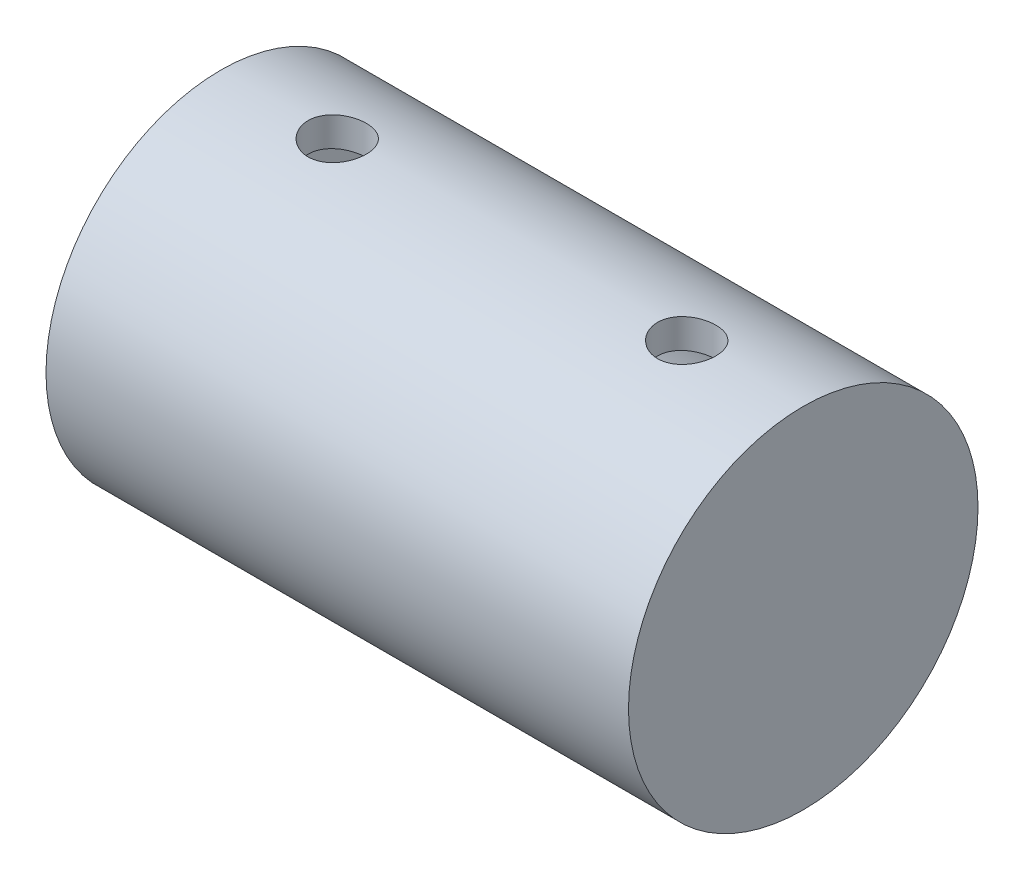
ISO-10303-21;
HEADER;
FILE_DESCRIPTION(('STEP AP214'),'2;1');
FILE_NAME('part.step','',(''),(''),'','','');
FILE_SCHEMA(('AUTOMOTIVE_DESIGN { 1 0 10303 214 1 1 1 1 }'));
ENDSEC;
DATA;
#1=APPLICATION_CONTEXT('core data for automotive mechanical design processes');
#2=APPLICATION_PROTOCOL_DEFINITION('international standard','automotive_design',2000,#1);
#3=PRODUCT_CONTEXT('',#1,'mechanical');
#4=PRODUCT('Part','Part','',(#3));
#5=PRODUCT_RELATED_PRODUCT_CATEGORY('part','',(#4));
#6=PRODUCT_DEFINITION_FORMATION('','',#4);
#7=PRODUCT_DEFINITION_CONTEXT('part definition',#1,'design');
#8=PRODUCT_DEFINITION('design','',#6,#7);
#9=PRODUCT_DEFINITION_SHAPE('','',#8);
#10=(LENGTH_UNIT() NAMED_UNIT(*) SI_UNIT(.MILLI.,.METRE.));
#11=(NAMED_UNIT(*) PLANE_ANGLE_UNIT() SI_UNIT($,.RADIAN.));
#12=(NAMED_UNIT(*) SI_UNIT($,.STERADIAN.) SOLID_ANGLE_UNIT());
#13=UNCERTAINTY_MEASURE_WITH_UNIT(LENGTH_MEASURE(1.E-05),#10,'distance_accuracy_value','');
#14=(GEOMETRIC_REPRESENTATION_CONTEXT(3) GLOBAL_UNCERTAINTY_ASSIGNED_CONTEXT((#13)) GLOBAL_UNIT_ASSIGNED_CONTEXT((#10,
#11,#12)) REPRESENTATION_CONTEXT('',''));
#15=CARTESIAN_POINT('',(0.,0.,0.));
#16=DIRECTION('',(0.,0.,1.));
#17=DIRECTION('',(1.,0.,0.));
#18=AXIS2_PLACEMENT_3D('',#15,#16,#17);
#19=CARTESIAN_POINT('',(25.,0.,0.));
#20=DIRECTION('',(-1.,0.,0.));
#21=DIRECTION('',(0.,0.,1.));
#22=AXIS2_PLACEMENT_3D('',#19,#20,#21);
#23=CYLINDRICAL_SURFACE('',#22,12.5);
#24=CARTESIAN_POINT('',(15.,12.2474487139159,-2.50000000000002));
#25=CARTESIAN_POINT('',(14.8610890612721,12.2474514756662,-2.4999948646882));
#26=CARTESIAN_POINT('',(14.7221134416666,12.2498377067175,-2.48838292929538));
#27=CARTESIAN_POINT('',(14.4480937371422,12.2591107826219,-2.44228070895713));
#28=CARTESIAN_POINT('',(14.31305288841,12.2660012286197,-2.40777211767626));
#29=CARTESIAN_POINT('',(14.0509067416145,12.2834718430464,-2.31698945654938));
#30=CARTESIAN_POINT('',(13.9237936961685,12.2940483405269,-2.26073703538157));
#31=CARTESIAN_POINT('',(13.6808128882576,12.3176949870165,-2.12812276917628));
#32=CARTESIAN_POINT('',(13.5649444986552,12.3307649968365,-2.0517620465029));
#33=CARTESIAN_POINT('',(13.3460974903653,12.3581324923563,-1.87994768913361));
#34=CARTESIAN_POINT('',(13.2433010302901,12.3724434459312,-1.78426413978331));
#35=CARTESIAN_POINT('',(13.0551061660525,12.400561807565,-1.57701697255329));
#36=CARTESIAN_POINT('',(12.969708981457,12.4143691802708,-1.46545224244497));
#37=CARTESIAN_POINT('',(12.8180299559288,12.440069910439,-1.22840338981065));
#38=CARTESIAN_POINT('',(12.7519212154584,12.4519455360388,-1.10280641918054));
#39=CARTESIAN_POINT('',(12.6418126573796,12.4722934220908,-0.842010375968186));
#40=CARTESIAN_POINT('',(12.5978107702475,12.480766001103,-0.706812203551389));
#41=CARTESIAN_POINT('',(12.5337320159509,12.4932580172105,-0.43254193319624));
#42=CARTESIAN_POINT('',(12.5133475560725,12.4973346572032,-0.293544348037038));
#43=CARTESIAN_POINT('',(12.4961226204042,12.5007730295901,-0.0140464210938411));
#44=CARTESIAN_POINT('',(12.4992798758854,12.500135216319,0.126453774579609));
#45=CARTESIAN_POINT('',(12.5288154505389,12.4942608717129,0.402855001858975));
#46=CARTESIAN_POINT('',(12.5548624429196,12.489089959146,0.538793035746179));
#47=CARTESIAN_POINT('',(12.6289125811472,12.4748044289852,0.80432906645076));
#48=CARTESIAN_POINT('',(12.6769166054797,12.465689653601,0.933926809367831));
#49=CARTESIAN_POINT('',(12.7938251003681,12.444432400499,1.18404865800223));
#50=CARTESIAN_POINT('',(12.8628593777622,12.4322712043806,1.30451043533476));
#51=CARTESIAN_POINT('',(13.0197726930915,12.4062617368446,1.5322626146494));
#52=CARTESIAN_POINT('',(13.1076538994263,12.3924132713806,1.63955149881252));
#53=CARTESIAN_POINT('',(13.3015840552712,12.3642741091115,1.83987857763366));
#54=CARTESIAN_POINT('',(13.407922966824,12.3499799114379,1.9326357914341));
#55=CARTESIAN_POINT('',(13.6347911061269,12.322789289969,2.09904623294204));
#56=CARTESIAN_POINT('',(13.755320602208,12.3098928926137,2.1726990993194));
#57=CARTESIAN_POINT('',(14.0075520795545,12.2869511868231,2.29890703700472));
#58=CARTESIAN_POINT('',(14.1392774190991,12.2769120390887,2.3514166194443));
#59=CARTESIAN_POINT('',(14.40992830931,12.2609119080318,2.43347585406898));
#60=CARTESIAN_POINT('',(14.5488529190477,12.2549503932107,2.46302849864163));
#61=CARTESIAN_POINT('',(14.8274121449976,12.2478869816957,2.49791501509015));
#62=CARTESIAN_POINT('',(14.9669939357758,12.2467036764289,2.5036546472448));
#63=CARTESIAN_POINT('',(15.2451205579992,12.2491121422213,2.49184407077687));
#64=CARTESIAN_POINT('',(15.3836654477972,12.2527036425097,2.47429518280613));
#65=CARTESIAN_POINT('',(15.6544216007306,12.2641808123729,2.41675552018541));
#66=CARTESIAN_POINT('',(15.7866808575894,12.2720249753624,2.37698155209827));
#67=CARTESIAN_POINT('',(16.0426581975719,12.2910872337916,2.27635258827131));
#68=CARTESIAN_POINT('',(16.1663755760893,12.3023056071567,2.21549585593296));
#69=CARTESIAN_POINT('',(16.4035327748754,12.327035149051,2.07351035553901));
#70=CARTESIAN_POINT('',(16.5168176157521,12.3405742966226,1.9921276949569));
#71=CARTESIAN_POINT('',(16.7282707800023,12.3683430956659,1.8117389305318));
#72=CARTESIAN_POINT('',(16.8264375456232,12.3825728180955,1.71273101286136));
#73=CARTESIAN_POINT('',(17.006406397964,12.4103836467304,1.49808068374474));
#74=CARTESIAN_POINT('',(17.087934136625,12.4239514427171,1.38220624732409));
#75=CARTESIAN_POINT('',(17.230364703749,12.4486781907155,1.1381697415869));
#76=CARTESIAN_POINT('',(17.291268398362,12.4598372438803,1.01000818858378));
#77=CARTESIAN_POINT('',(17.3903221793666,12.4784323515267,0.745756702060042));
#78=CARTESIAN_POINT('',(17.4286012955657,12.4858894785651,0.609716683695204));
#79=CARTESIAN_POINT('',(17.4817281191596,12.4963308984415,0.332973636699784));
#80=CARTESIAN_POINT('',(17.4965786486892,12.4993157299962,0.192271171778033));
#81=CARTESIAN_POINT('',(17.5023174524073,12.5004635113529,-0.0871822347590515));
#82=CARTESIAN_POINT('',(17.4936182011406,12.4987094637332,-0.225924530353734));
#83=CARTESIAN_POINT('',(17.4534151236305,12.4907510890085,-0.499927578289127));
#84=CARTESIAN_POINT('',(17.4219115841297,12.4845468178608,-0.63518837438431));
#85=CARTESIAN_POINT('',(17.337177519771,12.468387459123,-0.898131874362667));
#86=CARTESIAN_POINT('',(17.2839965546726,12.4584409311904,-1.02583110810042));
#87=CARTESIAN_POINT('',(17.1574693966722,12.435868053092,-1.27055305046518));
#88=CARTESIAN_POINT('',(17.0841216102388,12.4232414911747,-1.38757491441962));
#89=CARTESIAN_POINT('',(16.9179515323468,12.3964399789185,-1.6096597252648));
#90=CARTESIAN_POINT('',(16.8248341590406,12.3822433354475,-1.71449929028712));
#91=CARTESIAN_POINT('',(16.6223743997531,12.3540305726966,-1.90720654439628));
#92=CARTESIAN_POINT('',(16.5130281763002,12.340014496968,-1.9950702080223));
#93=CARTESIAN_POINT('',(16.2798017082739,12.3135835683483,-2.15223054862497));
#94=CARTESIAN_POINT('',(16.1557775971969,12.3011875892806,-2.22131703654524));
#95=CARTESIAN_POINT('',(15.8976680668498,12.2796309281603,-2.33756012316559));
#96=CARTESIAN_POINT('',(15.763591903282,12.2704673131246,-2.38473661493543));
#97=CARTESIAN_POINT('',(15.5243438613928,12.2582420284461,-2.44667284964416));
#98=CARTESIAN_POINT('',(15.4205364512151,12.2542196228651,-2.46663474630923));
#99=CARTESIAN_POINT('',(15.2111651136222,12.2488219614771,-2.4933000448993));
#100=CARTESIAN_POINT('',(15.1056012468888,12.2474466144104,-2.50000390390663));
#101=CARTESIAN_POINT('',(15.,12.2474487139159,-2.50000000000002));
#102=B_SPLINE_CURVE_WITH_KNOTS('',3,(#24,#25,#26,#27,#28,#29,#30,#31,#32,#33,#34,#35,#36,#37,
#38,#39,#40,#41,#42,#43,#44,#45,#46,#47,#48,#49,#50,#51,#52,#53,#54,#55,#56,#57,#58,#59,#60,#61,
#62,#63,#64,#65,#66,#67,#68,#69,#70,#71,#72,#73,#74,#75,#76,#77,#78,#79,#80,#81,#82,#83,#84,#85,
#86,#87,#88,#89,#90,#91,#92,#93,#94,#95,#96,#97,#98,#99,#100,#101),.UNSPECIFIED.,.T.,.F.,(4,2,2,
2,2,2,2,2,2,2,2,2,2,2,2,2,2,2,2,2,2,2,2,2,2,2,2,2,2,2,2,2,2,2,2,2,2,2,4),(0.,0.416346159673572,
0.833025598210749,1.24929124485148,1.66553366214967,2.08705631371094,2.50860850088557,
2.93383501093628,3.35902170616403,3.77860622207705,4.19815030290625,4.61171974083848,
5.0253057268438,5.44149810555763,5.8577383942517,6.28123366906214,6.70473695306807,
7.12914657931948,7.55350087540069,7.97059394511491,8.38766336321062,8.80073354458305,
9.21383775886004,9.63232649436312,10.0508583217553,10.4758150433364,10.9007539157527,
11.3232453394664,11.7456858672908,12.1607754353673,12.575859784169,12.9900004268864,
13.4041738033672,13.82502880064,14.2459834722447,14.6714724644903,15.0965743772551,
15.4130950909542,15.7296048921372),.UNSPECIFIED.);
#103=CARTESIAN_POINT('',(15.,12.2474487139159,-2.50000000000002));
#104=VERTEX_POINT('',#103);
#105=EDGE_CURVE('E54',#104,#104,#102,.T.);
#106=ORIENTED_EDGE('',*,*,#105,.T.);
#107=EDGE_LOOP('',(#106));
#108=FACE_BOUND('',#107,.T.);
#109=CARTESIAN_POINT('',(-20.,0.,0.));
#110=DIRECTION('',(1.,0.,0.));
#111=DIRECTION('',(0.,0.,-1.));
#112=AXIS2_PLACEMENT_3D('',#109,#110,#111);
#113=CIRCLE('',#112,12.5);
#114=CARTESIAN_POINT('',(-20.,0.,-12.5));
#115=VERTEX_POINT('',#114);
#116=EDGE_CURVE('E10',#115,#115,#113,.T.);
#117=ORIENTED_EDGE('',*,*,#116,.F.);
#118=EDGE_LOOP('',(#117));
#119=FACE_BOUND('',#118,.T.);
#120=CARTESIAN_POINT('',(20.,0.,0.));
#121=DIRECTION('',(1.,0.,0.));
#122=DIRECTION('',(0.,0.,-1.));
#123=AXIS2_PLACEMENT_3D('',#120,#121,#122);
#124=CIRCLE('',#123,12.5);
#125=CARTESIAN_POINT('',(20.,0.,-12.5));
#126=VERTEX_POINT('',#125);
#127=EDGE_CURVE('E86',#126,#126,#124,.T.);
#128=ORIENTED_EDGE('',*,*,#127,.T.);
#129=EDGE_LOOP('',(#128));
#130=FACE_BOUND('',#129,.T.);
#131=CARTESIAN_POINT('',(-15.,12.2474487139159,-2.5));
#132=CARTESIAN_POINT('',(-15.1389109387279,12.2474514756662,-2.49999486468818));
#133=CARTESIAN_POINT('',(-15.2778865583333,12.2498377067175,-2.48838292929536));
#134=CARTESIAN_POINT('',(-15.5519062628578,12.2591107826219,-2.4422807089571));
#135=CARTESIAN_POINT('',(-15.6869471115899,12.2660012286197,-2.40777211767623));
#136=CARTESIAN_POINT('',(-15.9490932583855,12.2834718430464,-2.31698945654936));
#137=CARTESIAN_POINT('',(-16.0762063038315,12.2940483405269,-2.26073703538155));
#138=CARTESIAN_POINT('',(-16.3191871117424,12.3176949870165,-2.12812276917626));
#139=CARTESIAN_POINT('',(-16.4350555013448,12.3307649968365,-2.05176204650288));
#140=CARTESIAN_POINT('',(-16.6539025096347,12.3581324923563,-1.87994768913359));
#141=CARTESIAN_POINT('',(-16.7566989697099,12.3724434459312,-1.78426413978329));
#142=CARTESIAN_POINT('',(-16.9448938339475,12.400561807565,-1.57701697255327));
#143=CARTESIAN_POINT('',(-17.030291018543,12.4143691802708,-1.46545224244496));
#144=CARTESIAN_POINT('',(-17.1819700440711,12.4400699104391,-1.22840338981064));
#145=CARTESIAN_POINT('',(-17.2480787845416,12.4519455360388,-1.10280641918053));
#146=CARTESIAN_POINT('',(-17.3581873426203,12.4722934220908,-0.842010375968181));
#147=CARTESIAN_POINT('',(-17.4021892297525,12.480766001103,-0.706812203551384));
#148=CARTESIAN_POINT('',(-17.4662679840491,12.4932580172105,-0.432541933196237));
#149=CARTESIAN_POINT('',(-17.4866524439275,12.4973346572032,-0.293544348037036));
#150=CARTESIAN_POINT('',(-17.5038773795958,12.5007730295901,-0.0140464210938419));
#151=CARTESIAN_POINT('',(-17.5007201241146,12.500135216319,0.126453774579607));
#152=CARTESIAN_POINT('',(-17.4711845494611,12.4942608717129,0.402855001858971));
#153=CARTESIAN_POINT('',(-17.4451375570804,12.489089959146,0.538793035746175));
#154=CARTESIAN_POINT('',(-17.3710874188528,12.4748044289852,0.804329066450753));
#155=CARTESIAN_POINT('',(-17.3230833945203,12.465689653601,0.933926809367823));
#156=CARTESIAN_POINT('',(-17.2061748996318,12.444432400499,1.18404865800222));
#157=CARTESIAN_POINT('',(-17.1371406222378,12.4322712043806,1.30451043533475));
#158=CARTESIAN_POINT('',(-16.9802273069085,12.4062617368446,1.53226261464939));
#159=CARTESIAN_POINT('',(-16.8923461005737,12.3924132713806,1.6395514988125));
#160=CARTESIAN_POINT('',(-16.6984159447288,12.3642741091115,1.83987857763364));
#161=CARTESIAN_POINT('',(-16.592077033176,12.3499799114379,1.93263579143408));
#162=CARTESIAN_POINT('',(-16.3652088938731,12.322789289969,2.09904623294202));
#163=CARTESIAN_POINT('',(-16.244679397792,12.3098928926137,2.17269909931938));
#164=CARTESIAN_POINT('',(-15.9924479204455,12.2869511868231,2.2989070370047));
#165=CARTESIAN_POINT('',(-15.8607225809008,12.2769120390887,2.35141661944427));
#166=CARTESIAN_POINT('',(-15.59007169069,12.2609119080318,2.43347585406895));
#167=CARTESIAN_POINT('',(-15.4511470809523,12.2549503932107,2.46302849864161));
#168=CARTESIAN_POINT('',(-15.1725878550024,12.2478869816957,2.49791501509013));
#169=CARTESIAN_POINT('',(-15.0330060642241,12.2467036764289,2.50365464724478));
#170=CARTESIAN_POINT('',(-14.7548794420008,12.2491121422213,2.49184407077685));
#171=CARTESIAN_POINT('',(-14.6163345522028,12.2527036425097,2.47429518280611));
#172=CARTESIAN_POINT('',(-14.3455783992694,12.2641808123729,2.41675552018539));
#173=CARTESIAN_POINT('',(-14.2133191424106,12.2720249753624,2.37698155209825));
#174=CARTESIAN_POINT('',(-13.9573418024281,12.2910872337916,2.27635258827129));
#175=CARTESIAN_POINT('',(-13.8336244239107,12.3023056071567,2.21549585593294));
#176=CARTESIAN_POINT('',(-13.5964672251246,12.327035149051,2.073510355539));
#177=CARTESIAN_POINT('',(-13.4831823842479,12.3405742966226,1.99212769495688));
#178=CARTESIAN_POINT('',(-13.2717292199977,12.3683430956659,1.81173893053178));
#179=CARTESIAN_POINT('',(-13.1735624543769,12.3825728180955,1.71273101286134));
#180=CARTESIAN_POINT('',(-12.9935936020361,12.4103836467304,1.49808068374473));
#181=CARTESIAN_POINT('',(-12.912065863375,12.4239514427171,1.38220624732407));
#182=CARTESIAN_POINT('',(-12.769635296251,12.4486781907155,1.13816974158689));
#183=CARTESIAN_POINT('',(-12.708731601638,12.4598372438803,1.01000818858377));
#184=CARTESIAN_POINT('',(-12.6096778206334,12.4784323515267,0.745756702060032));
#185=CARTESIAN_POINT('',(-12.5713987044344,12.4858894785651,0.609716683695196));
#186=CARTESIAN_POINT('',(-12.5182718808404,12.4963308984415,0.332973636699779));
#187=CARTESIAN_POINT('',(-12.5034213513108,12.4993157299962,0.192271171778029));
#188=CARTESIAN_POINT('',(-12.4976825475928,12.5004635113529,-0.0871822347590535));
#189=CARTESIAN_POINT('',(-12.5063817988594,12.4987094637332,-0.225924530353735));
#190=CARTESIAN_POINT('',(-12.5465848763696,12.4907510890085,-0.499927578289125));
#191=CARTESIAN_POINT('',(-12.5780884158703,12.4845468178608,-0.635188374384306));
#192=CARTESIAN_POINT('',(-12.662822480229,12.468387459123,-0.898131874362662));
#193=CARTESIAN_POINT('',(-12.7160034453274,12.4584409311904,-1.02583110810041));
#194=CARTESIAN_POINT('',(-12.8425306033278,12.435868053092,-1.27055305046517));
#195=CARTESIAN_POINT('',(-12.9158783897612,12.4232414911747,-1.38757491441961));
#196=CARTESIAN_POINT('',(-13.0820484676532,12.3964399789185,-1.60965972526479));
#197=CARTESIAN_POINT('',(-13.1751658409594,12.3822433354475,-1.71449929028711));
#198=CARTESIAN_POINT('',(-13.3776256002469,12.3540305726966,-1.90720654439627));
#199=CARTESIAN_POINT('',(-13.4869718236998,12.340014496968,-1.99507020802229));
#200=CARTESIAN_POINT('',(-13.7201982917261,12.3135835683483,-2.15223054862496));
#201=CARTESIAN_POINT('',(-13.8442224028031,12.3011875892806,-2.22131703654523));
#202=CARTESIAN_POINT('',(-14.1023319331503,12.2796309281603,-2.33756012316557));
#203=CARTESIAN_POINT('',(-14.236408096718,12.2704673131246,-2.38473661493541));
#204=CARTESIAN_POINT('',(-14.4756561386072,12.2582420284461,-2.44667284964414));
#205=CARTESIAN_POINT('',(-14.5794635487849,12.2542196228651,-2.46663474630921));
#206=CARTESIAN_POINT('',(-14.7888348863778,12.2488219614771,-2.49330004489928));
#207=CARTESIAN_POINT('',(-14.8943987531112,12.2474466144105,-2.50000390390661));
#208=CARTESIAN_POINT('',(-15.,12.2474487139159,-2.5));
#209=B_SPLINE_CURVE_WITH_KNOTS('',3,(#131,#132,#133,#134,#135,#136,#137,#138,#139,#140,#141,
#142,#143,#144,#145,#146,#147,#148,#149,#150,#151,#152,#153,#154,#155,#156,#157,#158,#159,#160,
#161,#162,#163,#164,#165,#166,#167,#168,#169,#170,#171,#172,#173,#174,#175,#176,#177,#178,#179,
#180,#181,#182,#183,#184,#185,#186,#187,#188,#189,#190,#191,#192,#193,#194,#195,#196,#197,#198,
#199,#200,#201,#202,#203,#204,#205,#206,#207,#208),.UNSPECIFIED.,.T.,.F.,(4,2,2,2,2,2,2,2,2,2,2,
2,2,2,2,2,2,2,2,2,2,2,2,2,2,2,2,2,2,2,2,2,2,2,2,2,2,2,4),(0.,0.416346159673569,
0.833025598210743,1.24929124485146,1.66553366214966,2.08705631371092,2.50860850088555,
2.93383501093625,3.35902170616399,3.77860622207701,4.19815030290621,4.61171974083844,
5.02530572684376,5.44149810555758,5.85773839425165,6.28123366906208,6.704736953068,
7.12914657931941,7.55350087540062,7.97059394511484,8.38766336321054,8.80073354458297,
9.21383775885996,9.63232649436303,10.0508583217552,10.4758150433363,10.9007539157526,
11.3232453394663,11.7456858672907,12.1607754353672,12.5758597841689,12.9900004268863,
13.4041738033671,13.8250288006399,14.2459834722445,14.6714724644902,15.096574377255,
15.413095090954,15.729604892137),.UNSPECIFIED.);
#210=CARTESIAN_POINT('',(-15.,12.2474487139159,-2.5));
#211=VERTEX_POINT('',#210);
#212=EDGE_CURVE('E37',#211,#211,#209,.T.);
#213=ORIENTED_EDGE('',*,*,#212,.T.);
#214=EDGE_LOOP('',(#213));
#215=FACE_BOUND('',#214,.T.);
#216=ADVANCED_FACE('F32',(#108,#119,#130,#215),#23,.F.);
#217=CARTESIAN_POINT('',(-20.,0.,0.));
#218=DIRECTION('',(1.,0.,0.));
#219=DIRECTION('',(0.,0.,-1.));
#220=AXIS2_PLACEMENT_3D('',#217,#218,#219);
#221=PLANE('',#220);
#222=ORIENTED_EDGE('',*,*,#116,.T.);
#223=EDGE_LOOP('',(#222));
#224=FACE_BOUND('',#223,.T.);
#225=ADVANCED_FACE('F72',(#224),#221,.T.);
#226=CARTESIAN_POINT('',(20.,0.,0.));
#227=DIRECTION('',(1.,0.,0.));
#228=DIRECTION('',(0.,0.,-1.));
#229=AXIS2_PLACEMENT_3D('',#226,#227,#228);
#230=PLANE('',#229);
#231=ORIENTED_EDGE('',*,*,#127,.F.);
#232=EDGE_LOOP('',(#231));
#233=FACE_BOUND('',#232,.T.);
#234=ADVANCED_FACE('F69',(#233),#230,.F.);
#235=CARTESIAN_POINT('',(15.,15.,0.));
#236=DIRECTION('',(0.,-1.,0.));
#237=DIRECTION('',(0.,0.,-1.));
#238=AXIS2_PLACEMENT_3D('',#235,#236,#237);
#239=CYLINDRICAL_SURFACE('',#238,2.50000000000002);
#240=ORIENTED_EDGE('',*,*,#105,.F.);
#241=EDGE_LOOP('',(#240));
#242=FACE_BOUND('',#241,.T.);
#243=CARTESIAN_POINT('',(12.5,15.,0.));
#244=CARTESIAN_POINT('',(12.5000055889478,14.9999976116882,0.139390904958216));
#245=CARTESIAN_POINT('',(12.5116972749689,14.9980367791303,0.278857881838823));
#246=CARTESIAN_POINT('',(12.5581356587653,14.9904034494139,0.553880221673048));
#247=CARTESIAN_POINT('',(12.5929035569116,14.9847275392389,0.689431867959254));
#248=CARTESIAN_POINT('',(12.6844154485927,14.9703006823645,0.952604747212653));
#249=CARTESIAN_POINT('',(12.7411414656406,14.9615522515919,1.08023236843191));
#250=CARTESIAN_POINT('',(12.8749122920524,14.9419422708207,1.32414184197796));
#251=CARTESIAN_POINT('',(12.951954777483,14.9310809625443,1.4404249898786));
#252=CARTESIAN_POINT('',(13.1249550838204,14.9083331745831,1.6594726142917));
#253=CARTESIAN_POINT('',(13.2210691146361,14.8964387181486,1.76211290353498));
#254=CARTESIAN_POINT('',(13.4291479684728,14.8730262687673,1.94988849865995));
#255=CARTESIAN_POINT('',(13.5411137914566,14.8615082996267,2.03502269939099));
#256=CARTESIAN_POINT('',(13.778570966197,14.8400756575978,2.18586712560515));
#257=CARTESIAN_POINT('',(13.9041413368047,14.8301712909164,2.25145455286102));
#258=CARTESIAN_POINT('',(14.1647095643006,14.8131978979467,2.36055836541124));
#259=CARTESIAN_POINT('',(14.2997067836776,14.8061286801431,2.40407624156564));
#260=CARTESIAN_POINT('',(14.5739802748565,14.7957053684275,2.46741437778483));
#261=CARTESIAN_POINT('',(14.7132057365014,14.792317684857,2.48744902913543));
#262=CARTESIAN_POINT('',(14.9930802768835,14.7895393893665,2.5039167252899));
#263=CARTESIAN_POINT('',(15.1337292541673,14.7901484945721,2.50035144038902));
#264=CARTESIAN_POINT('',(15.4109278612755,14.7952642886355,2.46989509839618));
#265=CARTESIAN_POINT('',(15.5475048035452,14.7997307331892,2.4432448818898));
#266=CARTESIAN_POINT('',(15.8142213178291,14.8119949521101,2.36775314040347));
#267=CARTESIAN_POINT('',(15.9443606688886,14.8197928407327,2.31891085431976));
#268=CARTESIAN_POINT('',(16.1952288234409,14.837884793341,2.20017724609393));
#269=CARTESIAN_POINT('',(16.3159094060812,14.8481906710733,2.13018591387974));
#270=CARTESIAN_POINT('',(16.5439044005384,14.8701291841501,1.97121201755745));
#271=CARTESIAN_POINT('',(16.6512177324549,14.8817619265429,1.88222792065431));
#272=CARTESIAN_POINT('',(16.8508260858074,14.9052202787979,1.68648221215907));
#273=CARTESIAN_POINT('',(16.9429185185401,14.9170464923165,1.57951396387314));
#274=CARTESIAN_POINT('',(17.1078777626654,14.9394260139672,1.35153524898166));
#275=CARTESIAN_POINT('',(17.1807444501832,14.9499793138975,1.23052469190643));
#276=CARTESIAN_POINT('',(17.3052022271363,14.9686389289291,0.97770591616672));
#277=CARTESIAN_POINT('',(17.3567754193313,14.9767431840745,0.845888725564669));
#278=CARTESIAN_POINT('',(17.436994215246,14.9895750301266,0.575298345602737));
#279=CARTESIAN_POINT('',(17.4656417369737,14.9943029035047,0.436525739179473));
#280=CARTESIAN_POINT('',(17.4989213584612,14.9998112984269,0.157709901301625));
#281=CARTESIAN_POINT('',(17.5038315718056,15.0006375301278,0.017700737151012));
#282=CARTESIAN_POINT('',(17.4902386555719,14.9983747442117,-0.261139772889889));
#283=CARTESIAN_POINT('',(17.4717364268663,14.9952858772412,-0.399971163892042));
#284=CARTESIAN_POINT('',(17.4120751506645,14.985568269382,-0.671656175546769));
#285=CARTESIAN_POINT('',(17.3710537916099,14.9789610480131,-0.804540868385385));
#286=CARTESIAN_POINT('',(17.2676654818005,14.9629446445536,-1.06154688486045));
#287=CARTESIAN_POINT('',(17.2052973323647,14.9535353051202,-1.18566771590973));
#288=CARTESIAN_POINT('',(17.0603488753032,14.9328451630241,-1.42283068946897));
#289=CARTESIAN_POINT('',(16.9775948438328,14.9215485588702,-1.53576525093716));
#290=CARTESIAN_POINT('',(16.794462684615,14.898384673919,-1.7462435855027));
#291=CARTESIAN_POINT('',(16.6940832767233,14.8865173517155,-1.8437862396966));
#292=CARTESIAN_POINT('',(16.4773024519286,14.8634017523585,-2.02174277965802));
#293=CARTESIAN_POINT('',(16.3607458344856,14.8521611613711,-2.10196876111373));
#294=CARTESIAN_POINT('',(16.1156470308615,14.8317152977788,-2.24170231029501));
#295=CARTESIAN_POINT('',(15.9871052247725,14.8225099606602,-2.30121053476985));
#296=CARTESIAN_POINT('',(15.7222102671879,14.807234536977,-2.39753833147317));
#297=CARTESIAN_POINT('',(15.5858919049695,14.8011515431106,-2.43445143254797));
#298=CARTESIAN_POINT('',(15.3088798707782,14.7927771683526,-2.4848354537783));
#299=CARTESIAN_POINT('',(15.1681865802679,14.7904854578272,-2.49830841194619));
#300=CARTESIAN_POINT('',(14.8882948340376,14.7899673308401,-2.50137286604738));
#301=CARTESIAN_POINT('',(14.7490996214247,14.7916905650565,-2.49126013612521));
#302=CARTESIAN_POINT('',(14.4744207519492,14.7988978145373,-2.44807983895687));
#303=CARTESIAN_POINT('',(14.3389370830581,14.8043818176121,-2.4150123461125));
#304=CARTESIAN_POINT('',(14.0756415627074,14.8184735628172,-2.32697448959492));
#305=CARTESIAN_POINT('',(13.947820989944,14.8270776721967,-2.27202959060046));
#306=CARTESIAN_POINT('',(13.7031643308051,14.8464436892221,-2.14182700391593));
#307=CARTESIAN_POINT('',(13.5863287896279,14.857205703884,-2.06656830874858));
#308=CARTESIAN_POINT('',(13.3654644168922,14.8798345404562,-1.89681888437217));
#309=CARTESIAN_POINT('',(13.2616039832997,14.891712955763,-1.80211056359367));
#310=CARTESIAN_POINT('',(13.071148395525,14.9151437236084,-1.59660903138025));
#311=CARTESIAN_POINT('',(12.9845572313618,14.9266960002655,-1.48581211291265));
#312=CARTESIAN_POINT('',(12.8305517318,14.9482652964222,-1.25036916964029));
#313=CARTESIAN_POINT('',(12.763273960687,14.958271162531,-1.12563278753283));
#314=CARTESIAN_POINT('',(12.6507305153901,14.9755116760178,-0.86651306937899));
#315=CARTESIAN_POINT('',(12.6054429189203,14.9827490817748,-0.732139494830018));
#316=CARTESIAN_POINT('',(12.5479947258733,14.9920579083296,-0.497703310045407));
#317=CARTESIAN_POINT('',(12.530025530384,14.9950202727336,-0.399058830298452));
#318=CARTESIAN_POINT('',(12.5060262621552,14.9989921598612,-0.200289310319812));
#319=CARTESIAN_POINT('',(12.4999959838626,15.0000017162064,-0.100164295608495));
#320=CARTESIAN_POINT('',(12.5,15.,0.));
#321=B_SPLINE_CURVE_WITH_KNOTS('',3,(#243,#244,#245,#246,#247,#248,#249,#250,#251,#252,#253,
#254,#255,#256,#257,#258,#259,#260,#261,#262,#263,#264,#265,#266,#267,#268,#269,#270,#271,#272,
#273,#274,#275,#276,#277,#278,#279,#280,#281,#282,#283,#284,#285,#286,#287,#288,#289,#290,#291,
#292,#293,#294,#295,#296,#297,#298,#299,#300,#301,#302,#303,#304,#305,#306,#307,#308,#309,#310,
#311,#312,#313,#314,#315,#316,#317,#318,#319,#320),.UNSPECIFIED.,.T.,.F.,(4,2,2,2,2,2,2,2,2,2,2,
2,2,2,2,2,2,2,2,2,2,2,2,2,2,2,2,2,2,2,2,2,2,2,2,2,2,2,4),(0.,0.417806584938513,
0.835997545695428,1.25384686702528,1.67164841267481,2.09302491062334,2.51442800169859,
2.93842520823843,3.36239376876184,3.78246077103427,4.2024980432089,4.61820521760413,
5.03392665025386,5.45164556632562,5.86939820680579,6.29232769911332,6.71525991635854,
7.1385468891591,7.56179844521156,7.98007883491405,8.39834313035867,8.81407807006424,
9.22983635826075,9.64926825627033,10.0687306305429,10.4925382200763,10.9163323737595,
11.3383602234178,11.7603513778663,12.1770790952271,12.5938054618814,13.0100481822623,
13.4263115502935,13.847513841934,14.2688133387899,14.6930223160721,15.1168075213009,
15.4170424816403,15.7172722727698),.UNSPECIFIED.);
#322=CARTESIAN_POINT('',(12.5,15.,0.));
#323=VERTEX_POINT('',#322);
#324=EDGE_CURVE('E60',#323,#323,#321,.T.);
#325=ORIENTED_EDGE('',*,*,#324,.T.);
#326=EDGE_LOOP('',(#325));
#327=FACE_BOUND('',#326,.T.);
#328=ADVANCED_FACE('F64',(#242,#327),#239,.F.);
#329=CARTESIAN_POINT('',(-15.,15.,0.));
#330=DIRECTION('',(0.,-1.,0.));
#331=DIRECTION('',(0.,0.,-1.));
#332=AXIS2_PLACEMENT_3D('',#329,#330,#331);
#333=CYLINDRICAL_SURFACE('',#332,2.5);
#334=ORIENTED_EDGE('',*,*,#212,.F.);
#335=EDGE_LOOP('',(#334));
#336=FACE_BOUND('',#335,.T.);
#337=CARTESIAN_POINT('',(-17.5,15.,0.));
#338=CARTESIAN_POINT('',(-17.4999944110522,14.9999976116882,0.139390904958215));
#339=CARTESIAN_POINT('',(-17.4883027250311,14.9980367791303,0.278857881838821));
#340=CARTESIAN_POINT('',(-17.4418643412347,14.9904034494139,0.553880221673043));
#341=CARTESIAN_POINT('',(-17.4070964430884,14.9847275392389,0.689431867959247));
#342=CARTESIAN_POINT('',(-17.3155845514072,14.9703006823645,0.952604747212644));
#343=CARTESIAN_POINT('',(-17.2588585343594,14.9615522515919,1.0802323684319));
#344=CARTESIAN_POINT('',(-17.1250877079476,14.9419422708207,1.32414184197795));
#345=CARTESIAN_POINT('',(-17.048045222517,14.9310809625443,1.44042498987859));
#346=CARTESIAN_POINT('',(-16.8750449161795,14.9083331745831,1.65947261429168));
#347=CARTESIAN_POINT('',(-16.7789308853639,14.8964387181486,1.76211290353497));
#348=CARTESIAN_POINT('',(-16.5708520315272,14.8730262687673,1.94988849865993));
#349=CARTESIAN_POINT('',(-16.4588862085434,14.8615082996267,2.03502269939097));
#350=CARTESIAN_POINT('',(-16.2214290338029,14.8400756575978,2.18586712560513));
#351=CARTESIAN_POINT('',(-16.0958586631952,14.8301712909164,2.251454552861));
#352=CARTESIAN_POINT('',(-15.8352904356994,14.8131978979467,2.36055836541122));
#353=CARTESIAN_POINT('',(-15.7002932163224,14.8061286801431,2.40407624156561));
#354=CARTESIAN_POINT('',(-15.4260197251435,14.7957053684276,2.46741437778481));
#355=CARTESIAN_POINT('',(-15.2867942634986,14.792317684857,2.4874490291354));
#356=CARTESIAN_POINT('',(-15.0069197231165,14.7895393893665,2.50391672528988));
#357=CARTESIAN_POINT('',(-14.8662707458327,14.7901484945721,2.500351440389));
#358=CARTESIAN_POINT('',(-14.5890721387245,14.7952642886356,2.46989509839615));
#359=CARTESIAN_POINT('',(-14.4524951964548,14.7997307331892,2.44324488188977));
#360=CARTESIAN_POINT('',(-14.1857786821709,14.8119949521101,2.36775314040344));
#361=CARTESIAN_POINT('',(-14.0556393311115,14.8197928407327,2.31891085431974));
#362=CARTESIAN_POINT('',(-13.8047711765591,14.837884793341,2.20017724609391));
#363=CARTESIAN_POINT('',(-13.6840905939188,14.8481906710733,2.13018591387971));
#364=CARTESIAN_POINT('',(-13.4560955994616,14.8701291841501,1.97121201755743));
#365=CARTESIAN_POINT('',(-13.3487822675451,14.8817619265429,1.88222792065429));
#366=CARTESIAN_POINT('',(-13.1491739141927,14.9052202787979,1.68648221215905));
#367=CARTESIAN_POINT('',(-13.0570814814599,14.9170464923165,1.57951396387313));
#368=CARTESIAN_POINT('',(-12.8921222373347,14.9394260139672,1.35153524898165));
#369=CARTESIAN_POINT('',(-12.8192555498168,14.9499793138975,1.23052469190642));
#370=CARTESIAN_POINT('',(-12.6947977728637,14.9686389289291,0.97770591616671));
#371=CARTESIAN_POINT('',(-12.6432245806687,14.9767431840745,0.84588872556466));
#372=CARTESIAN_POINT('',(-12.563005784754,14.9895750301266,0.575298345602731));
#373=CARTESIAN_POINT('',(-12.5343582630263,14.9943029035047,0.436525739179467));
#374=CARTESIAN_POINT('',(-12.5010786415389,14.9998112984269,0.157709901301623));
#375=CARTESIAN_POINT('',(-12.4961684281944,15.0006375301278,0.0177007371510108));
#376=CARTESIAN_POINT('',(-12.5097613444281,14.9983747442117,-0.261139772889888));
#377=CARTESIAN_POINT('',(-12.5282635731337,14.9952858772412,-0.399971163892039));
#378=CARTESIAN_POINT('',(-12.5879248493355,14.985568269382,-0.671656175546764));
#379=CARTESIAN_POINT('',(-12.6289462083901,14.9789610480131,-0.80454086838538));
#380=CARTESIAN_POINT('',(-12.7323345181995,14.9629446445536,-1.06154688486044));
#381=CARTESIAN_POINT('',(-12.7947026676353,14.9535353051202,-1.18566771590972));
#382=CARTESIAN_POINT('',(-12.9396511246968,14.9328451630241,-1.42283068946896));
#383=CARTESIAN_POINT('',(-13.0224051561673,14.9215485588702,-1.53576525093715));
#384=CARTESIAN_POINT('',(-13.2055373153851,14.898384673919,-1.74624358550269));
#385=CARTESIAN_POINT('',(-13.3059167232767,14.8865173517155,-1.84378623969658));
#386=CARTESIAN_POINT('',(-13.5226975480714,14.8634017523585,-2.021742779658));
#387=CARTESIAN_POINT('',(-13.6392541655144,14.8521611613711,-2.10196876111372));
#388=CARTESIAN_POINT('',(-13.8843529691385,14.8317152977788,-2.24170231029499));
#389=CARTESIAN_POINT('',(-14.0128947752275,14.8225099606602,-2.30121053476982));
#390=CARTESIAN_POINT('',(-14.2777897328121,14.807234536977,-2.39753833147315));
#391=CARTESIAN_POINT('',(-14.4141080950305,14.8011515431106,-2.43445143254795));
#392=CARTESIAN_POINT('',(-14.6911201292218,14.7927771683526,-2.48483545377828));
#393=CARTESIAN_POINT('',(-14.8318134197321,14.7904854578272,-2.49830841194617));
#394=CARTESIAN_POINT('',(-15.1117051659624,14.7899673308401,-2.50137286604735));
#395=CARTESIAN_POINT('',(-15.2509003785753,14.7916905650565,-2.49126013612519));
#396=CARTESIAN_POINT('',(-15.5255792480508,14.7988978145373,-2.44807983895685));
#397=CARTESIAN_POINT('',(-15.6610629169419,14.8043818176121,-2.41501234611248));
#398=CARTESIAN_POINT('',(-15.9243584372926,14.8184735628172,-2.3269744895949));
#399=CARTESIAN_POINT('',(-16.052179010056,14.8270776721967,-2.27202959060044));
#400=CARTESIAN_POINT('',(-16.2968356691948,14.8464436892221,-2.14182700391591));
#401=CARTESIAN_POINT('',(-16.4136712103721,14.857205703884,-2.06656830874856));
#402=CARTESIAN_POINT('',(-16.6345355831078,14.8798345404562,-1.89681888437215));
#403=CARTESIAN_POINT('',(-16.7383960167003,14.891712955763,-1.80211056359365));
#404=CARTESIAN_POINT('',(-16.9288516044749,14.9151437236084,-1.59660903138023));
#405=CARTESIAN_POINT('',(-17.0154427686382,14.9266960002655,-1.48581211291263));
#406=CARTESIAN_POINT('',(-17.1694482681999,14.9482652964222,-1.25036916964028));
#407=CARTESIAN_POINT('',(-17.236726039313,14.958271162531,-1.12563278753282));
#408=CARTESIAN_POINT('',(-17.3492694846099,14.9755116760178,-0.86651306937898));
#409=CARTESIAN_POINT('',(-17.3945570810797,14.9827490817748,-0.732139494830009));
#410=CARTESIAN_POINT('',(-17.4520052741267,14.9920579083296,-0.4977033100454));
#411=CARTESIAN_POINT('',(-17.469974469616,14.9950202727336,-0.399058830298447));
#412=CARTESIAN_POINT('',(-17.4939737378448,14.9989921598612,-0.200289310319809));
#413=CARTESIAN_POINT('',(-17.5000040161374,15.0000017162064,-0.100164295608494));
#414=CARTESIAN_POINT('',(-17.5,15.,0.));
#415=B_SPLINE_CURVE_WITH_KNOTS('',3,(#337,#338,#339,#340,#341,#342,#343,#344,#345,#346,#347,
#348,#349,#350,#351,#352,#353,#354,#355,#356,#357,#358,#359,#360,#361,#362,#363,#364,#365,#366,
#367,#368,#369,#370,#371,#372,#373,#374,#375,#376,#377,#378,#379,#380,#381,#382,#383,#384,#385,
#386,#387,#388,#389,#390,#391,#392,#393,#394,#395,#396,#397,#398,#399,#400,#401,#402,#403,#404,
#405,#406,#407,#408,#409,#410,#411,#412,#413,#414),.UNSPECIFIED.,.T.,.F.,(4,2,2,2,2,2,2,2,2,2,2,
2,2,2,2,2,2,2,2,2,2,2,2,2,2,2,2,2,2,2,2,2,2,2,2,2,2,2,4),(0.,0.41780658493851,0.835997545695421,
1.25384686702527,1.67164841267479,2.09302491062332,2.51442800169857,2.9384252082384,
3.36239376876181,3.78246077103424,4.20249804320886,4.61820521760409,5.03392665025381,
5.45164556632557,5.86939820680574,6.29232769911327,6.71525991635848,7.13854688915903,
7.56179844521149,7.98007883491397,8.3983431303586,8.81407807006416,9.22983635826067,
9.64926825627024,10.0687306305428,10.4925382200762,10.9163323737594,11.3383602234177,
11.7603513778662,12.177079095227,12.5938054618813,13.0100481822622,13.4263115502934,
13.8475138419339,14.2688133387897,14.693022316072,15.1168075213007,15.4170424816402,
15.7172722727697),.UNSPECIFIED.);
#416=CARTESIAN_POINT('',(-17.5,15.,0.));
#417=VERTEX_POINT('',#416);
#418=EDGE_CURVE('E80',#417,#417,#415,.T.);
#419=ORIENTED_EDGE('',*,*,#418,.T.);
#420=EDGE_LOOP('',(#419));
#421=FACE_BOUND('',#420,.T.);
#422=ADVANCED_FACE('F68',(#336,#421),#333,.F.);
#423=CARTESIAN_POINT('',(25.,0.,0.));
#424=DIRECTION('',(-1.,0.,0.));
#425=DIRECTION('',(0.,0.,1.));
#426=AXIS2_PLACEMENT_3D('',#423,#424,#425);
#427=CYLINDRICAL_SURFACE('',#426,15.);
#428=CARTESIAN_POINT('',(25.,0.,0.));
#429=DIRECTION('',(1.,0.,0.));
#430=DIRECTION('',(0.,0.,-1.));
#431=AXIS2_PLACEMENT_3D('',#428,#429,#430);
#432=CIRCLE('',#431,15.);
#433=CARTESIAN_POINT('',(25.,0.,-15.));
#434=VERTEX_POINT('',#433);
#435=EDGE_CURVE('E46',#434,#434,#432,.T.);
#436=ORIENTED_EDGE('',*,*,#435,.F.);
#437=EDGE_LOOP('',(#436));
#438=FACE_BOUND('',#437,.T.);
#439=CARTESIAN_POINT('',(-25.,0.,0.));
#440=DIRECTION('',(1.,0.,0.));
#441=DIRECTION('',(0.,0.,-1.));
#442=AXIS2_PLACEMENT_3D('',#439,#440,#441);
#443=CIRCLE('',#442,15.);
#444=CARTESIAN_POINT('',(-25.,0.,-15.));
#445=VERTEX_POINT('',#444);
#446=EDGE_CURVE('E51',#445,#445,#443,.T.);
#447=ORIENTED_EDGE('',*,*,#446,.T.);
#448=EDGE_LOOP('',(#447));
#449=FACE_BOUND('',#448,.T.);
#450=ORIENTED_EDGE('',*,*,#324,.F.);
#451=EDGE_LOOP('',(#450));
#452=FACE_BOUND('',#451,.T.);
#453=ORIENTED_EDGE('',*,*,#418,.F.);
#454=EDGE_LOOP('',(#453));
#455=FACE_BOUND('',#454,.T.);
#456=ADVANCED_FACE('F34',(#438,#449,#452,#455),#427,.T.);
#457=CARTESIAN_POINT('',(25.,0.,0.));
#458=DIRECTION('',(1.,0.,0.));
#459=DIRECTION('',(0.,0.,-1.));
#460=AXIS2_PLACEMENT_3D('',#457,#458,#459);
#461=PLANE('',#460);
#462=ORIENTED_EDGE('',*,*,#435,.T.);
#463=EDGE_LOOP('',(#462));
#464=FACE_BOUND('',#463,.T.);
#465=ADVANCED_FACE('F97',(#464),#461,.T.);
#466=CARTESIAN_POINT('',(-25.,0.,0.));
#467=DIRECTION('',(1.,0.,0.));
#468=DIRECTION('',(0.,0.,-1.));
#469=AXIS2_PLACEMENT_3D('',#466,#467,#468);
#470=PLANE('',#469);
#471=ORIENTED_EDGE('',*,*,#446,.F.);
#472=EDGE_LOOP('',(#471));
#473=FACE_BOUND('',#472,.T.);
#474=ADVANCED_FACE('F95',(#473),#470,.F.);
#475=CLOSED_SHELL('',(#216,#225,#234,#328,#422,#456,#465,#474));
#476=MANIFOLD_SOLID_BREP('B2',#475);
#477=ADVANCED_BREP_SHAPE_REPRESENTATION('',(#18,#476),#14);
#478=SHAPE_DEFINITION_REPRESENTATION(#9,#477);
ENDSEC;
END-ISO-10303-21;
